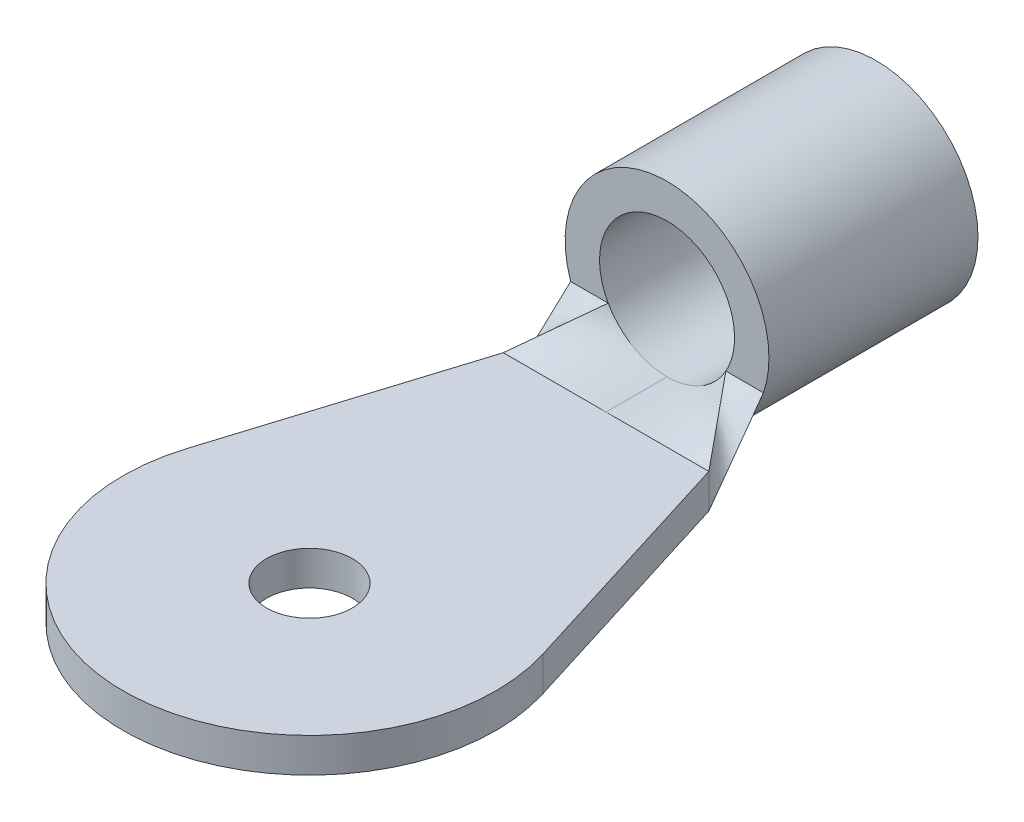
ISO-10303-21;
HEADER;
FILE_DESCRIPTION(('STEP AP214'),'2;1');
FILE_NAME('part.step','',(''),(''),'','','');
FILE_SCHEMA(('AUTOMOTIVE_DESIGN { 1 0 10303 214 1 1 1 1 }'));
ENDSEC;
DATA;
#1=APPLICATION_CONTEXT('core data for automotive mechanical design processes');
#2=APPLICATION_PROTOCOL_DEFINITION('international standard','automotive_design',2000,#1);
#3=PRODUCT_CONTEXT('',#1,'mechanical');
#4=PRODUCT('Part','Part','',(#3));
#5=PRODUCT_RELATED_PRODUCT_CATEGORY('part','',(#4));
#6=PRODUCT_DEFINITION_FORMATION('','',#4);
#7=PRODUCT_DEFINITION_CONTEXT('part definition',#1,'design');
#8=PRODUCT_DEFINITION('design','',#6,#7);
#9=PRODUCT_DEFINITION_SHAPE('','',#8);
#10=(LENGTH_UNIT() NAMED_UNIT(*) SI_UNIT(.MILLI.,.METRE.));
#11=(NAMED_UNIT(*) PLANE_ANGLE_UNIT() SI_UNIT($,.RADIAN.));
#12=(NAMED_UNIT(*) SI_UNIT($,.STERADIAN.) SOLID_ANGLE_UNIT());
#13=UNCERTAINTY_MEASURE_WITH_UNIT(LENGTH_MEASURE(1.E-05),#10,'distance_accuracy_value','');
#14=(GEOMETRIC_REPRESENTATION_CONTEXT(3) GLOBAL_UNCERTAINTY_ASSIGNED_CONTEXT((#13)) GLOBAL_UNIT_ASSIGNED_CONTEXT((#10,
#11,#12)) REPRESENTATION_CONTEXT('',''));
#15=CARTESIAN_POINT('',(0.,0.,0.));
#16=DIRECTION('',(0.,0.,1.));
#17=DIRECTION('',(1.,0.,0.));
#18=AXIS2_PLACEMENT_3D('',#15,#16,#17);
#19=CARTESIAN_POINT('',(0.,2.9718,-20.47354018104));
#20=DIRECTION('',(0.,0.,-1.));
#21=DIRECTION('',(0.,-1.,0.));
#22=AXIS2_PLACEMENT_3D('',#19,#20,#21);
#23=TOROIDAL_SURFACE('',#22,4.7371,2.7686);
#24=CARTESIAN_POINT('',(0.,2.9718,-20.47354018104));
#25=DIRECTION('',(0.,0.,1.));
#26=DIRECTION('',(1.,0.,0.));
#27=AXIS2_PLACEMENT_3D('',#24,#25,#26);
#28=CIRCLE('',#27,1.9685);
#29=CARTESIAN_POINT('',(1.9685,2.9718,-20.47354018104));
#30=VERTEX_POINT('',#29);
#31=EDGE_CURVE('E407',#30,#30,#28,.T.);
#32=ORIENTED_EDGE('',*,*,#31,.T.);
#33=EDGE_LOOP('',(#32));
#34=FACE_BOUND('',#33,.T.);
#35=CARTESIAN_POINT('',(0.,2.9718,-21.9583));
#36=DIRECTION('',(0.,0.,-1.));
#37=DIRECTION('',(-1.,0.,0.));
#38=AXIS2_PLACEMENT_3D('',#35,#36,#37);
#39=CIRCLE('',#38,2.4002999999996);
#40=CARTESIAN_POINT('',(-2.4002999999996,2.9718,-21.9583));
#41=VERTEX_POINT('',#40);
#42=EDGE_CURVE('E406',#41,#41,#39,.F.);
#43=ORIENTED_EDGE('',*,*,#42,.F.);
#44=EDGE_LOOP('',(#43));
#45=FACE_BOUND('',#44,.T.);
#46=ADVANCED_FACE('F43',(#34,#45),#23,.T.);
#47=CARTESIAN_POINT('',(0.,2.9718,-15.5575));
#48=DIRECTION('',(0.,0.,1.));
#49=DIRECTION('',(1.,0.,0.));
#50=AXIS2_PLACEMENT_3D('',#47,#48,#49);
#51=CYLINDRICAL_SURFACE('',#50,1.9685);
#52=ORIENTED_EDGE('',*,*,#31,.F.);
#53=EDGE_LOOP('',(#52));
#54=FACE_BOUND('',#53,.T.);
#55=CARTESIAN_POINT('',(1.73567280692567,2.04312774495081,-15.8622999999999));
#56=CARTESIAN_POINT('',(1.72912048872111,2.03088157255962,-15.8622999999999));
#57=CARTESIAN_POINT('',(1.55542623465408,1.71425828052444,-15.8622999999999));
#58=CARTESIAN_POINT('',(1.04117832760495,1.19140008908232,-15.8622999999999));
#59=CARTESIAN_POINT('',(0.333338600034629,0.999581116255773,-15.8622999999999));
#60=CARTESIAN_POINT('',(-0.0277778049131523,1.00344699680981,-15.8622999999999));
#61=CARTESIAN_POINT('',(-0.0416635961835322,1.00374095750298,-15.8622999999999));
#62=B_SPLINE_CURVE_WITH_KNOTS('',3,(#55,#56,#57,#58,#59,#60,#61),.UNSPECIFIED.,.F.,.F.,(4,1,1,1,
4),(-0.02,0.,0.5,1.,1.02),.UNSPECIFIED.);
#63=CARTESIAN_POINT('',(1.71562851748047,2.00660000000332,-15.8623000000008));
#64=VERTEX_POINT('',#63);
#65=CARTESIAN_POINT('',(0.,1.00329999999982,-15.8623));
#66=VERTEX_POINT('',#65);
#67=EDGE_CURVE('E241',#64,#66,#62,.T.);
#68=ORIENTED_EDGE('',*,*,#67,.F.);
#69=CARTESIAN_POINT('',(0.,2.9718,-15.8623));
#70=DIRECTION('',(0.,0.,1.));
#71=DIRECTION('',(1.,0.,0.));
#72=AXIS2_PLACEMENT_3D('',#69,#70,#71);
#73=CIRCLE('',#72,1.9685);
#74=CARTESIAN_POINT('',(-1.71562851748025,2.00660000000342,-15.8623000000009));
#75=VERTEX_POINT('',#74);
#76=EDGE_CURVE('E402',#64,#75,#73,.T.);
#77=ORIENTED_EDGE('',*,*,#76,.T.);
#78=CARTESIAN_POINT('',(0.0416635961835409,1.00374095750298,-15.8623));
#79=CARTESIAN_POINT('',(0.0277778049131612,1.00344699680981,-15.8623));
#80=CARTESIAN_POINT('',(-0.333338600034622,0.999581116255773,-15.8623));
#81=CARTESIAN_POINT('',(-1.04117832760493,1.19140008908233,-15.8623));
#82=CARTESIAN_POINT('',(-1.55542623465404,1.71425828052447,-15.8623));
#83=CARTESIAN_POINT('',(-1.72912048872105,2.03088157255967,-15.8623));
#84=CARTESIAN_POINT('',(-1.73567280692561,2.04312774495086,-15.8623));
#85=B_SPLINE_CURVE_WITH_KNOTS('',3,(#78,#79,#80,#81,#82,#83,#84),.UNSPECIFIED.,.F.,.F.,(4,1,1,1,
4),(-0.02,0.,0.5,1.,1.02),.UNSPECIFIED.);
#86=EDGE_CURVE('E240',#66,#75,#85,.T.);
#87=ORIENTED_EDGE('',*,*,#86,.F.);
#88=EDGE_LOOP('',(#68,#77,#87));
#89=FACE_BOUND('',#88,.T.);
#90=ADVANCED_FACE('F409',(#54,#89),#51,.F.);
#91=CARTESIAN_POINT('',(0.,2.9718,-15.8623));
#92=DIRECTION('',(0.,0.,-1.));
#93=DIRECTION('',(-1.,0.,0.));
#94=AXIS2_PLACEMENT_3D('',#91,#92,#93);
#95=PLANE('',#94);
#96=DIRECTION('',(-1.,-2.6112567753143E-11,0.));
#97=VECTOR('',#96,1.);
#98=CARTESIAN_POINT('',(-2.26315978564953,2.00660000000011,-15.8623000000003));
#99=LINE('',#98,#97);
#100=CARTESIAN_POINT('',(-2.81069105381626,2.00659999999977,-15.8623000000002));
#101=VERTEX_POINT('',#100);
#102=EDGE_CURVE('E198',#75,#101,#99,.T.);
#103=ORIENTED_EDGE('',*,*,#102,.F.);
#104=ORIENTED_EDGE('',*,*,#76,.F.);
#105=DIRECTION('',(-1.,2.6388266055217E-11,0.));
#106=VECTOR('',#105,1.);
#107=CARTESIAN_POINT('',(2.26315978564952,2.00659999999979,-15.8622999999999));
#108=LINE('',#107,#106);
#109=CARTESIAN_POINT('',(2.81069105381625,2.00659999999938,-15.8623));
#110=VERTEX_POINT('',#109);
#111=EDGE_CURVE('E229',#110,#64,#108,.T.);
#112=ORIENTED_EDGE('',*,*,#111,.F.);
#113=CARTESIAN_POINT('',(0.,2.9718,-15.8623));
#114=DIRECTION('',(0.,0.,1.));
#115=DIRECTION('',(1.,0.,0.));
#116=AXIS2_PLACEMENT_3D('',#113,#114,#115);
#117=CIRCLE('',#116,2.9718);
#118=EDGE_CURVE('E184',#101,#110,#117,.F.);
#119=ORIENTED_EDGE('',*,*,#118,.F.);
#120=EDGE_LOOP('',(#103,#104,#112,#119));
#121=FACE_BOUND('',#120,.T.);
#122=ADVANCED_FACE('F401',(#121),#95,.F.);
#123=CARTESIAN_POINT('',(0.,2.9718,-21.9583));
#124=DIRECTION('',(0.,0.,-1.));
#125=DIRECTION('',(-1.,0.,0.));
#126=AXIS2_PLACEMENT_3D('',#123,#124,#125);
#127=PLANE('',#126);
#128=ORIENTED_EDGE('',*,*,#42,.T.);
#129=EDGE_LOOP('',(#128));
#130=FACE_BOUND('',#129,.T.);
#131=CARTESIAN_POINT('',(0.,2.9718,-21.9583));
#132=DIRECTION('',(0.,0.,1.));
#133=DIRECTION('',(1.,0.,0.));
#134=AXIS2_PLACEMENT_3D('',#131,#132,#133);
#135=CIRCLE('',#134,2.9718);
#136=CARTESIAN_POINT('',(2.9718,2.9718,-21.9583));
#137=VERTEX_POINT('',#136);
#138=EDGE_CURVE('E178',#137,#137,#135,.T.);
#139=ORIENTED_EDGE('',*,*,#138,.F.);
#140=EDGE_LOOP('',(#139));
#141=FACE_BOUND('',#140,.T.);
#142=ADVANCED_FACE('F427',(#130,#141),#127,.T.);
#143=CARTESIAN_POINT('',(-0.06030960807633,1.00329118085,-14.04874));
#144=CARTESIAN_POINT('',(-0.05397240141995,1.003444046118,-14.66511333333));
#145=CARTESIAN_POINT('',(-0.04763519476358,1.003596911386,-15.28148666667));
#146=CARTESIAN_POINT('',(-0.0412979881072,1.003749776653,-15.89786));
#147=CARTESIAN_POINT('',(-0.04020636390174,1.003297060064,-14.04874));
#148=CARTESIAN_POINT('',(-0.03598227849385,1.003348018958,-14.66511333333));
#149=CARTESIAN_POINT('',(-0.03175819308597,1.003398977852,-15.28148666667));
#150=CARTESIAN_POINT('',(-0.02753410767808,1.003449936746,-15.89786));
#151=CARTESIAN_POINT('',(0.4824762679993,1.003374377675,-14.04874));
#152=CARTESIAN_POINT('',(0.4317889560113,1.002085164644,-14.66511333333));
#153=CARTESIAN_POINT('',(0.3811016440233,1.000795951612,-15.28148666667));
#154=CARTESIAN_POINT('',(0.3304143320353,0.9995067385809,-15.89786));
#155=CARTESIAN_POINT('',(1.507748433448,0.9995379982183,-14.04874));
#156=CARTESIAN_POINT('',(1.349175587017,1.0647460291,-14.66511333333));
#157=CARTESIAN_POINT('',(1.190602740587,1.129954059982,-15.28148666667));
#158=CARTESIAN_POINT('',(1.032029894157,1.195162090864,-15.89786));
#159=CARTESIAN_POINT('',(2.536892435307,0.9890808343895,-14.04874));
#160=CARTESIAN_POINT('',(2.20332222332,1.235546371638,-14.66511333333));
#161=CARTESIAN_POINT('',(1.869752011334,1.482011908887,-15.28148666667));
#162=CARTESIAN_POINT('',(1.536181799347,1.728477446135,-15.89786));
#163=CARTESIAN_POINT('',(3.063323510226,0.9827483685488,-14.04874));
#164=CARTESIAN_POINT('',(2.609868888538,1.338976647036,-14.66511333333));
#165=CARTESIAN_POINT('',(2.15641426685,1.695204925523,-15.28148666667));
#166=CARTESIAN_POINT('',(1.702959645162,2.051433204011,-15.89786));
#167=CARTESIAN_POINT('',(3.083573423861,0.982503445101,-14.04874));
#168=CARTESIAN_POINT('',(2.625463410262,1.342977063351,-14.66511333333));
#169=CARTESIAN_POINT('',(2.167353396663,1.7034506816,-15.28148666667));
#170=CARTESIAN_POINT('',(1.709243383064,2.06392429985,-15.89786));
#171=B_SPLINE_SURFACE_WITH_KNOTS('',3,3,((#143,#144,#145,#146),(#147,#148,#149,#150),(#151,#152,
#153,#154),(#155,#156,#157,#158),(#159,#160,#161,#162),(#163,#164,#165,#166),(#167,#168,#169,
#170)),.UNSPECIFIED.,.F.,.F.,.F.,(4,1,1,1,4),(4,4),(-0.02,0.,0.5,1.,1.02),(-0.02,1.02),.UNSPECIFIED.);
#172=DIRECTION('',(0.531670783971899,-0.416227502590126,0.737618359016567));
#173=VECTOR('',#172,1.);
#174=CARTESIAN_POINT('',(2.35641425874146,1.50494999999971,-14.9733));
#175=LINE('',#174,#173);
#176=CARTESIAN_POINT('',(2.99720000000075,1.00329999999958,-14.0843000000006));
#177=VERTEX_POINT('',#176);
#178=EDGE_CURVE('E211',#64,#177,#175,.T.);
#179=DIRECTION('',(0.,-2.66312963326112E-13,-1.));
#180=VECTOR('',#179,1.);
#181=CARTESIAN_POINT('',(0.,1.00329999999991,-14.9733));
#182=LINE('',#181,#180);
#183=CARTESIAN_POINT('',(0.,1.00330000000005,-14.0843));
#184=VERTEX_POINT('',#183);
#185=EDGE_CURVE('E237',#184,#66,#182,.T.);
#186=DIRECTION('',(1.,0.,0.));
#187=VECTOR('',#186,1.);
#188=CARTESIAN_POINT('',(0.,1.0033,-14.0843));
#189=LINE('',#188,#187);
#190=EDGE_CURVE('E183',#177,#184,#189,.F.);
#191=ORIENTED_EDGE('',*,*,#178,.F.);
#192=ORIENTED_EDGE('',*,*,#67,.T.);
#193=ORIENTED_EDGE('',*,*,#185,.F.);
#194=ORIENTED_EDGE('',*,*,#190,.F.);
#195=EDGE_LOOP('',(#191,#192,#193,#194));
#196=FACE_BOUND('',#195,.T.);
#197=ADVANCED_FACE('F267',(#196),#171,.T.);
#198=CARTESIAN_POINT('',(-3.083573423861,0.982503445101,-14.04874));
#199=CARTESIAN_POINT('',(-2.625463410262,1.342977063351,-14.66511333333));
#200=CARTESIAN_POINT('',(-2.167353396663,1.7034506816,-15.28148666667));
#201=CARTESIAN_POINT('',(-1.709243383064,2.06392429985,-15.89786));
#202=CARTESIAN_POINT('',(-3.063323510226,0.9827483685488,-14.04874));
#203=CARTESIAN_POINT('',(-2.609868888538,1.338976647036,-14.66511333333));
#204=CARTESIAN_POINT('',(-2.15641426685,1.695204925523,-15.28148666667));
#205=CARTESIAN_POINT('',(-1.702959645162,2.051433204011,-15.89786));
#206=CARTESIAN_POINT('',(-2.536892435307,0.9890808343895,-14.04874));
#207=CARTESIAN_POINT('',(-2.20332222332,1.235546371638,-14.66511333333));
#208=CARTESIAN_POINT('',(-1.869752011334,1.482011908887,-15.28148666667));
#209=CARTESIAN_POINT('',(-1.536181799347,1.728477446135,-15.89786));
#210=CARTESIAN_POINT('',(-1.507748433448,0.9995379982183,-14.04874));
#211=CARTESIAN_POINT('',(-1.349175587017,1.0647460291,-14.66511333333));
#212=CARTESIAN_POINT('',(-1.190602740587,1.129954059982,-15.28148666667));
#213=CARTESIAN_POINT('',(-1.032029894157,1.195162090864,-15.89786));
#214=CARTESIAN_POINT('',(-0.4824762679993,1.003374377675,-14.04874));
#215=CARTESIAN_POINT('',(-0.4317889560113,1.002085164644,-14.66511333333));
#216=CARTESIAN_POINT('',(-0.3811016440233,1.000795951612,-15.28148666667));
#217=CARTESIAN_POINT('',(-0.3304143320353,0.9995067385809,-15.89786));
#218=CARTESIAN_POINT('',(0.04020636390174,1.003297060064,-14.04874));
#219=CARTESIAN_POINT('',(0.03598227849385,1.003348018958,-14.66511333333));
#220=CARTESIAN_POINT('',(0.03175819308597,1.003398977852,-15.28148666667));
#221=CARTESIAN_POINT('',(0.02753410767809,1.003449936746,-15.89786));
#222=CARTESIAN_POINT('',(0.06030960807633,1.00329118085,-14.04874));
#223=CARTESIAN_POINT('',(0.05397240141996,1.003444046118,-14.66511333333));
#224=CARTESIAN_POINT('',(0.04763519476358,1.003596911386,-15.28148666667));
#225=CARTESIAN_POINT('',(0.04129798810721,1.003749776653,-15.89786));
#226=B_SPLINE_SURFACE_WITH_KNOTS('',3,3,((#198,#199,#200,#201),(#202,#203,#204,#205),(#206,#207,
#208,#209),(#210,#211,#212,#213),(#214,#215,#216,#217),(#218,#219,#220,#221),(#222,#223,#224,
#225)),.UNSPECIFIED.,.F.,.F.,.F.,(4,1,1,1,4),(4,4),(-0.02,0.,0.5,1.,1.02),(-0.02,1.02),.UNSPECIFIED.);
#227=DIRECTION('',(0.531670783972059,0.416227502589954,-0.737618359016548));
#228=VECTOR('',#227,1.);
#229=CARTESIAN_POINT('',(-2.35641425874125,1.5049499999999,-14.9733));
#230=LINE('',#229,#228);
#231=CARTESIAN_POINT('',(-2.99720000000051,1.00329999999967,-14.0843000000006));
#232=VERTEX_POINT('',#231);
#233=EDGE_CURVE('E226',#232,#75,#230,.T.);
#234=DIRECTION('',(1.,0.,0.));
#235=VECTOR('',#234,1.);
#236=CARTESIAN_POINT('',(0.,1.0033,-14.0843));
#237=LINE('',#236,#235);
#238=EDGE_CURVE('E219',#184,#232,#237,.F.);
#239=ORIENTED_EDGE('',*,*,#185,.T.);
#240=ORIENTED_EDGE('',*,*,#86,.T.);
#241=ORIENTED_EDGE('',*,*,#233,.F.);
#242=ORIENTED_EDGE('',*,*,#238,.F.);
#243=EDGE_LOOP('',(#239,#240,#241,#242));
#244=FACE_BOUND('',#243,.T.);
#245=ADVANCED_FACE('F254',(#244),#226,.T.);
#246=CARTESIAN_POINT('',(3.023492100984,1.014104774857,-14.04874));
#247=CARTESIAN_POINT('',(2.567762350591,1.351423413467,-14.66511333333));
#248=CARTESIAN_POINT('',(2.112032600198,1.688742052078,-15.28148666667));
#249=CARTESIAN_POINT('',(1.656302849805,2.026060690689,-15.89786));
#250=CARTESIAN_POINT('',(3.023271877206,1.003814516571,-14.04874));
#251=CARTESIAN_POINT('',(2.571359338964,1.344630497867,-14.66511333333));
#252=CARTESIAN_POINT('',(2.119446800723,1.685446479163,-15.28148666667));
#253=CARTESIAN_POINT('',(1.667534262481,2.026262460459,-15.89786));
#254=CARTESIAN_POINT('',(3.015751236519,0.6524022582855,-14.04874));
#255=CARTESIAN_POINT('',(2.694196470183,1.112652471156,-14.66511333333));
#256=CARTESIAN_POINT('',(2.372641703846,1.572902684026,-15.28148666667));
#257=CARTESIAN_POINT('',(2.05108693751,2.033152896896,-15.89786));
#258=CARTESIAN_POINT('',(3.008010372055,0.2906997417145,-14.04874));
#259=CARTESIAN_POINT('',(2.820630589775,0.8738815288442,-14.66511333333));
#260=CARTESIAN_POINT('',(2.633250807495,1.457063315974,-15.28148666667));
#261=CARTESIAN_POINT('',(2.445871025215,2.040245103104,-15.89786));
#262=CARTESIAN_POINT('',(3.000489731368,-0.06071251657109,-14.04874));
#263=CARTESIAN_POINT('',(2.943467720993,0.6419035021328,-14.66511333333));
#264=CARTESIAN_POINT('',(2.886445710618,1.344519520837,-15.28148666667));
#265=CARTESIAN_POINT('',(2.829423700244,2.047135539541,-15.89786));
#266=CARTESIAN_POINT('',(3.00026950759,-0.07100277485664,-14.04874));
#267=CARTESIAN_POINT('',(2.947064709366,0.6351105865325,-14.66511333333));
#268=CARTESIAN_POINT('',(2.893859911143,1.341223947922,-15.28148666667));
#269=CARTESIAN_POINT('',(2.84065511292,2.047337309311,-15.89786));
#270=B_SPLINE_SURFACE_WITH_KNOTS('',3,3,((#246,#247,#248,#249),(#250,#251,#252,#253),(#254,#255,
#256,#257),(#258,#259,#260,#261),(#262,#263,#264,#265),(#266,#267,#268,#269)),.UNSPECIFIED.,.F.,
.F.,.F.,(4,1,1,4),(4,4),(-0.03016591801627,0.,1.,1.030165918016),(-0.02,1.02),.UNSPECIFIED.);
#271=DIRECTION('',(0.0693993651602205,-0.746649257210498,0.661587949423483));
#272=VECTOR('',#271,1.);
#273=CARTESIAN_POINT('',(2.90394552690788,1.00329999999997,-14.9733));
#274=LINE('',#273,#272);
#275=CARTESIAN_POINT('',(2.9972,-5.9988906203623E-13,-14.0843000000007));
#276=VERTEX_POINT('',#275);
#277=EDGE_CURVE('E145',#110,#276,#274,.T.);
#278=DIRECTION('',(0.,1.,0.));
#279=VECTOR('',#278,1.);
#280=CARTESIAN_POINT('',(2.99720000000048,0.,-14.0843000000002));
#281=LINE('',#280,#279);
#282=EDGE_CURVE('E120',#276,#177,#281,.T.);
#283=ORIENTED_EDGE('',*,*,#277,.F.);
#284=ORIENTED_EDGE('',*,*,#111,.T.);
#285=ORIENTED_EDGE('',*,*,#178,.T.);
#286=ORIENTED_EDGE('',*,*,#282,.F.);
#287=EDGE_LOOP('',(#283,#284,#285,#286));
#288=FACE_BOUND('',#287,.T.);
#289=ADVANCED_FACE('F266',(#288),#270,.T.);
#290=CARTESIAN_POINT('',(-3.00026950759,-0.07100277485664,-14.04874));
#291=CARTESIAN_POINT('',(-2.947064709366,0.6351105865325,-14.66511333333));
#292=CARTESIAN_POINT('',(-2.893859911143,1.341223947922,-15.28148666667));
#293=CARTESIAN_POINT('',(-2.84065511292,2.047337309311,-15.89786));
#294=CARTESIAN_POINT('',(-3.000489731368,-0.06071251657109,-14.04874));
#295=CARTESIAN_POINT('',(-2.943467720993,0.6419035021328,-14.66511333333));
#296=CARTESIAN_POINT('',(-2.886445710618,1.344519520837,-15.28148666667));
#297=CARTESIAN_POINT('',(-2.829423700244,2.047135539541,-15.89786));
#298=CARTESIAN_POINT('',(-3.008010372055,0.2906997417145,-14.04874));
#299=CARTESIAN_POINT('',(-2.820630589775,0.8738815288442,-14.66511333333));
#300=CARTESIAN_POINT('',(-2.633250807495,1.457063315974,-15.28148666667));
#301=CARTESIAN_POINT('',(-2.445871025215,2.040245103104,-15.89786));
#302=CARTESIAN_POINT('',(-3.015751236519,0.6524022582855,-14.04874));
#303=CARTESIAN_POINT('',(-2.694196470183,1.112652471156,-14.66511333333));
#304=CARTESIAN_POINT('',(-2.372641703846,1.572902684026,-15.28148666667));
#305=CARTESIAN_POINT('',(-2.05108693751,2.033152896896,-15.89786));
#306=CARTESIAN_POINT('',(-3.023271877206,1.003814516571,-14.04874));
#307=CARTESIAN_POINT('',(-2.571359338964,1.344630497867,-14.66511333333));
#308=CARTESIAN_POINT('',(-2.119446800723,1.685446479163,-15.28148666667));
#309=CARTESIAN_POINT('',(-1.667534262481,2.026262460459,-15.89786));
#310=CARTESIAN_POINT('',(-3.023492100984,1.014104774857,-14.04874));
#311=CARTESIAN_POINT('',(-2.567762350591,1.351423413467,-14.66511333333));
#312=CARTESIAN_POINT('',(-2.112032600198,1.688742052078,-15.28148666667));
#313=CARTESIAN_POINT('',(-1.656302849805,2.026060690689,-15.89786));
#314=B_SPLINE_SURFACE_WITH_KNOTS('',3,3,((#290,#291,#292,#293),(#294,#295,#296,#297),(#298,#299,
#300,#301),(#302,#303,#304,#305),(#306,#307,#308,#309),(#310,#311,#312,#313)),.UNSPECIFIED.,.F.,
.F.,.F.,(4,1,1,4),(4,4),(-0.03016591801627,0.,1.,1.030165918016),(-0.02,1.02),.UNSPECIFIED.);
#315=DIRECTION('',(0.0693993651602916,0.746649257210564,-0.661587949423402));
#316=VECTOR('',#315,1.);
#317=CARTESIAN_POINT('',(-2.90394552690814,1.00330000000018,-14.9733));
#318=LINE('',#317,#316);
#319=CARTESIAN_POINT('',(-2.99719999999997,-5.95443833129039E-13,-14.0843000000007));
#320=VERTEX_POINT('',#319);
#321=EDGE_CURVE('E344',#320,#101,#318,.T.);
#322=DIRECTION('',(0.,1.,0.));
#323=VECTOR('',#322,1.);
#324=CARTESIAN_POINT('',(-2.9972,0.,-14.0843));
#325=LINE('',#324,#323);
#326=EDGE_CURVE('E135',#232,#320,#325,.F.);
#327=ORIENTED_EDGE('',*,*,#233,.T.);
#328=ORIENTED_EDGE('',*,*,#102,.T.);
#329=ORIENTED_EDGE('',*,*,#321,.F.);
#330=ORIENTED_EDGE('',*,*,#326,.F.);
#331=EDGE_LOOP('',(#327,#328,#329,#330));
#332=FACE_BOUND('',#331,.T.);
#333=ADVANCED_FACE('F281',(#332),#314,.T.);
#334=CARTESIAN_POINT('',(0.,2.9718,-15.5575));
#335=DIRECTION('',(0.,0.,1.));
#336=DIRECTION('',(1.,0.,0.));
#337=AXIS2_PLACEMENT_3D('',#334,#335,#336);
#338=CYLINDRICAL_SURFACE('',#337,2.9718);
#339=CARTESIAN_POINT('',(-0.0736937111272338,0.000913856617810988,-15.8623));
#340=CARTESIAN_POINT('',(-0.0491341771079927,0.000304650098919284,-15.8623));
#341=CARTESIAN_POINT('',(0.589627276546164,-0.00774236493291001,-15.8623));
#342=CARTESIAN_POINT('',(1.84083300811075,0.393302607661137,-15.8623));
#343=CARTESIAN_POINT('',(2.62651080902453,1.4464233252881,-15.8623));
#344=CARTESIAN_POINT('',(2.82636102838954,2.05316943277135,-15.8623));
#345=CARTESIAN_POINT('',(2.83376144932058,2.07659539302625,-15.8623));
#346=B_SPLINE_CURVE_WITH_KNOTS('',3,(#339,#340,#341,#342,#343,#344,#345),.UNSPECIFIED.,.F.,.F.,
(4,1,1,1,4),(-0.02,0.,0.5,1.,1.02),.UNSPECIFIED.);
#347=CARTESIAN_POINT('',(0.,0.,-15.8623000000001));
#348=VERTEX_POINT('',#347);
#349=EDGE_CURVE('E161',#348,#110,#346,.T.);
#350=ORIENTED_EDGE('',*,*,#349,.F.);
#351=CARTESIAN_POINT('',(-2.83376144932048,2.07659539302718,-15.8623000000008));
#352=CARTESIAN_POINT('',(-2.82636102838945,2.05316943277227,-15.8623000000008));
#353=CARTESIAN_POINT('',(-2.62651080902457,1.44642332528875,-15.8623000000008));
#354=CARTESIAN_POINT('',(-1.84083300811091,0.393302607661313,-15.8623000000008));
#355=CARTESIAN_POINT('',(-0.589627276546213,-0.00774236493291253,-15.8623000000008));
#356=CARTESIAN_POINT('',(0.0491341771079968,0.000304650098919421,-15.8623000000008));
#357=CARTESIAN_POINT('',(0.0736937111272399,0.000913856617811397,-15.8623000000008));
#358=B_SPLINE_CURVE_WITH_KNOTS('',3,(#351,#352,#353,#354,#355,#356,#357),.UNSPECIFIED.,.F.,.F.,
(4,1,1,1,4),(-0.02,0.,0.5,1.,1.02),.UNSPECIFIED.);
#359=EDGE_CURVE('E340',#101,#348,#358,.T.);
#360=ORIENTED_EDGE('',*,*,#359,.F.);
#361=ORIENTED_EDGE('',*,*,#118,.T.);
#362=EDGE_LOOP('',(#350,#360,#361));
#363=FACE_BOUND('',#362,.T.);
#364=ORIENTED_EDGE('',*,*,#138,.T.);
#365=EDGE_LOOP('',(#364));
#366=FACE_BOUND('',#365,.T.);
#367=ADVANCED_FACE('F291',(#363,#366),#338,.T.);
#368=CARTESIAN_POINT('',(0.,1.0033,0.));
#369=DIRECTION('',(0.,1.,0.));
#370=DIRECTION('',(0.,0.,1.));
#371=AXIS2_PLACEMENT_3D('',#368,#369,#370);
#372=PLANE('',#371);
#373=CARTESIAN_POINT('',(0.,1.0033,-5.4356));
#374=DIRECTION('',(0.,1.,0.));
#375=DIRECTION('',(0.,0.,1.));
#376=AXIS2_PLACEMENT_3D('',#373,#374,#375);
#377=CIRCLE('',#376,1.25);
#378=CARTESIAN_POINT('',(0.,1.0033,-4.1856));
#379=VERTEX_POINT('',#378);
#380=EDGE_CURVE('E507',#379,#379,#377,.T.);
#381=ORIENTED_EDGE('',*,*,#380,.F.);
#382=EDGE_LOOP('',(#381));
#383=FACE_BOUND('',#382,.T.);
#384=CARTESIAN_POINT('',(0.,1.0033,-5.4356));
#385=DIRECTION('',(0.,-1.,0.));
#386=DIRECTION('',(0.,0.,-1.));
#387=AXIS2_PLACEMENT_3D('',#384,#385,#386);
#388=CIRCLE('',#387,5.4356);
#389=CARTESIAN_POINT('',(5.18924004949497,1.0033,-7.0534798066361));
#390=VERTEX_POINT('',#389);
#391=CARTESIAN_POINT('',(-5.18924004949458,1.0033,-7.05347980663597));
#392=VERTEX_POINT('',#391);
#393=EDGE_CURVE('E127',#390,#392,#388,.T.);
#394=ORIENTED_EDGE('',*,*,#393,.F.);
#395=DIRECTION('',(-0.297645118595205,0.,-0.954676585748517));
#396=VECTOR('',#395,1.);
#397=CARTESIAN_POINT('',(5.189240049495,1.0033,-7.053479806636));
#398=LINE('',#397,#396);
#399=EDGE_CURVE('E112',#177,#390,#398,.F.);
#400=ORIENTED_EDGE('',*,*,#399,.F.);
#401=ORIENTED_EDGE('',*,*,#190,.T.);
#402=ORIENTED_EDGE('',*,*,#238,.T.);
#403=DIRECTION('',(-0.297645118595205,0.,0.954676585748517));
#404=VECTOR('',#403,1.);
#405=CARTESIAN_POINT('',(-2.9972,1.0033,-14.0843));
#406=LINE('',#405,#404);
#407=EDGE_CURVE('E131',#392,#232,#406,.F.);
#408=ORIENTED_EDGE('',*,*,#407,.F.);
#409=EDGE_LOOP('',(#394,#400,#401,#402,#408));
#410=FACE_BOUND('',#409,.T.);
#411=ADVANCED_FACE('F128',(#383,#410),#372,.T.);
#412=CARTESIAN_POINT('',(-2.9972,0.,-14.0843));
#413=DIRECTION('',(-0.954676585748517,0.,-0.297645118595205));
#414=DIRECTION('',(-0.297645118595205,0.,0.954676585748517));
#415=AXIS2_PLACEMENT_3D('',#412,#413,#414);
#416=PLANE('',#415);
#417=ORIENTED_EDGE('',*,*,#407,.T.);
#418=ORIENTED_EDGE('',*,*,#326,.T.);
#419=DIRECTION('',(-0.297645118595271,0.,0.954676585748497));
#420=VECTOR('',#419,1.);
#421=CARTESIAN_POINT('',(-2.9972,0.,-14.0843));
#422=LINE('',#421,#420);
#423=CARTESIAN_POINT('',(-5.18924004949477,0.,-7.05347980663623));
#424=VERTEX_POINT('',#423);
#425=EDGE_CURVE('E343',#320,#424,#422,.T.);
#426=ORIENTED_EDGE('',*,*,#425,.T.);
#427=DIRECTION('',(0.,-1.,0.));
#428=VECTOR('',#427,1.);
#429=CARTESIAN_POINT('',(-5.1892400494947,0.,-7.05347980663591));
#430=LINE('',#429,#428);
#431=EDGE_CURVE('E123',#392,#424,#430,.T.);
#432=ORIENTED_EDGE('',*,*,#431,.F.);
#433=EDGE_LOOP('',(#417,#418,#426,#432));
#434=FACE_BOUND('',#433,.T.);
#435=ADVANCED_FACE('F391',(#434),#416,.T.);
#436=CARTESIAN_POINT('',(0.,0.,-5.4356));
#437=DIRECTION('',(0.,-1.,0.));
#438=DIRECTION('',(0.,0.,-1.));
#439=AXIS2_PLACEMENT_3D('',#436,#437,#438);
#440=CYLINDRICAL_SURFACE('',#439,5.4356);
#441=ORIENTED_EDGE('',*,*,#431,.T.);
#442=CARTESIAN_POINT('',(0.,0.,-5.4356));
#443=DIRECTION('',(0.,-1.,0.));
#444=DIRECTION('',(0.,0.,-1.));
#445=AXIS2_PLACEMENT_3D('',#442,#443,#444);
#446=CIRCLE('',#445,5.4356);
#447=CARTESIAN_POINT('',(5.18924004949491,0.,-7.05347980663627));
#448=VERTEX_POINT('',#447);
#449=EDGE_CURVE('E140',#424,#448,#446,.F.);
#450=ORIENTED_EDGE('',*,*,#449,.T.);
#451=DIRECTION('',(0.,1.,0.));
#452=VECTOR('',#451,1.);
#453=CARTESIAN_POINT('',(5.189240049495,0.,-7.053479806636));
#454=LINE('',#453,#452);
#455=EDGE_CURVE('E117',#390,#448,#454,.F.);
#456=ORIENTED_EDGE('',*,*,#455,.F.);
#457=ORIENTED_EDGE('',*,*,#393,.T.);
#458=EDGE_LOOP('',(#441,#450,#456,#457));
#459=FACE_BOUND('',#458,.T.);
#460=ADVANCED_FACE('F138',(#459),#440,.T.);
#461=CARTESIAN_POINT('',(5.189240049495,0.,-7.053479806636));
#462=DIRECTION('',(0.954676585748517,0.,-0.297645118595205));
#463=DIRECTION('',(-0.297645118595205,0.,-0.954676585748517));
#464=AXIS2_PLACEMENT_3D('',#461,#462,#463);
#465=PLANE('',#464);
#466=DIRECTION('',(-0.297645118595271,0.,-0.954676585748497));
#467=VECTOR('',#466,1.);
#468=CARTESIAN_POINT('',(5.189240049495,0.,-7.053479806636));
#469=LINE('',#468,#467);
#470=EDGE_CURVE('E156',#448,#276,#469,.T.);
#471=ORIENTED_EDGE('',*,*,#470,.T.);
#472=ORIENTED_EDGE('',*,*,#282,.T.);
#473=ORIENTED_EDGE('',*,*,#399,.T.);
#474=ORIENTED_EDGE('',*,*,#455,.T.);
#475=EDGE_LOOP('',(#471,#472,#473,#474));
#476=FACE_BOUND('',#475,.T.);
#477=ADVANCED_FACE('F115',(#476),#465,.T.);
#478=CARTESIAN_POINT('',(3.061611651014,-0.04153190786052,-14.04874));
#479=CARTESIAN_POINT('',(2.984172366778,0.6783544950552,-14.66511333333));
#480=CARTESIAN_POINT('',(2.906733082542,1.398240897971,-15.28148666667));
#481=CARTESIAN_POINT('',(2.829293798307,2.118127300887,-15.89786));
#482=CARTESIAN_POINT('',(3.041378699432,-0.04106338865542,-14.04874));
#483=CARTESIAN_POINT('',(2.968300798163,0.6707020147053,-14.66511333333));
#484=CARTESIAN_POINT('',(2.895222896893,1.382467418066,-15.28148666667));
#485=CARTESIAN_POINT('',(2.822144995624,2.094232821427,-15.89786));
#486=CARTESIAN_POINT('',(2.51547074382,-0.02892846650577,-14.04874));
#487=CARTESIAN_POINT('',(2.553209850948,0.4724982862609,-14.66511333333));
#488=CARTESIAN_POINT('',(2.590948958077,0.9739250390277,-15.28148666667));
#489=CARTESIAN_POINT('',(2.628688065205,1.475351791794,-15.89786));
#490=CARTESIAN_POINT('',(1.491755339838,-0.007866052153224,-14.04874));
#491=CARTESIAN_POINT('',(1.610396115983,0.128478851836,-14.66511333333));
#492=CARTESIAN_POINT('',(1.729036892128,0.2648237558252,-15.28148666667));
#493=CARTESIAN_POINT('',(1.847677668273,0.4011686598144,-15.89786));
#494=CARTESIAN_POINT('',(0.4773504944691,0.0001548472986582,-14.04874));
#495=CARTESIAN_POINT('',(0.5155099236718,-0.002529172544751,-14.66511333333));
#496=CARTESIAN_POINT('',(0.5536693528744,-0.00521319238816,-15.28148666667));
#497=CARTESIAN_POINT('',(0.5918287820771,-0.007897212231569,-15.89786));
#498=CARTESIAN_POINT('',(-0.03977923645784,-6.093001978386E-06,-14.04874));
#499=CARTESIAN_POINT('',(-0.04295869341083,9.951903231364E-05,-14.66511333333));
#500=CARTESIAN_POINT('',(-0.04613815036383,0.0002051310666057,-15.28148666667));
#501=CARTESIAN_POINT('',(-0.04931760731682,0.0003107431008977,-15.89786));
#502=CARTESIAN_POINT('',(-0.05966900577746,-1.827713235622E-05,-14.04874));
#503=CARTESIAN_POINT('',(-0.06443557230156,0.0002985264951516,-14.66511333333));
#504=CARTESIAN_POINT('',(-0.06920213882567,0.0006153301226595,-15.28148666667));
#505=CARTESIAN_POINT('',(-0.07396870534978,0.0009321337501673,-15.89786));
#506=B_SPLINE_SURFACE_WITH_KNOTS('',3,3,((#478,#479,#480,#481),(#482,#483,#484,#485),(#486,#487,
#488,#489),(#490,#491,#492,#493),(#494,#495,#496,#497),(#498,#499,#500,#501),(#502,#503,#504,
#505)),.UNSPECIFIED.,.F.,.F.,.F.,(4,1,1,1,4),(4,4),(-0.02,0.,0.5,1.,1.02),(-0.02,1.02),.UNSPECIFIED.);
#507=DIRECTION('',(0.,0.,1.));
#508=VECTOR('',#507,1.);
#509=CARTESIAN_POINT('',(0.,0.,-14.9733));
#510=LINE('',#509,#508);
#511=CARTESIAN_POINT('',(0.,0.,-14.0843));
#512=VERTEX_POINT('',#511);
#513=EDGE_CURVE('E67',#348,#512,#510,.T.);
#514=DIRECTION('',(1.,0.,0.));
#515=VECTOR('',#514,1.);
#516=CARTESIAN_POINT('',(0.,0.,-14.0843));
#517=LINE('',#516,#515);
#518=EDGE_CURVE('E59',#276,#512,#517,.F.);
#519=ORIENTED_EDGE('',*,*,#513,.F.);
#520=ORIENTED_EDGE('',*,*,#349,.T.);
#521=ORIENTED_EDGE('',*,*,#277,.T.);
#522=ORIENTED_EDGE('',*,*,#518,.T.);
#523=EDGE_LOOP('',(#519,#520,#521,#522));
#524=FACE_BOUND('',#523,.T.);
#525=ADVANCED_FACE('F293',(#524),#506,.T.);
#526=CARTESIAN_POINT('',(0.05966900577746,-1.827713235622E-05,-14.04874));
#527=CARTESIAN_POINT('',(0.06443557230156,0.0002985264951516,-14.66511333333));
#528=CARTESIAN_POINT('',(0.06920213882567,0.0006153301226595,-15.28148666667));
#529=CARTESIAN_POINT('',(0.07396870534978,0.0009321337501673,-15.89786));
#530=CARTESIAN_POINT('',(0.03977923645784,-6.093001978386E-06,-14.04874));
#531=CARTESIAN_POINT('',(0.04295869341083,9.951903231363E-05,-14.66511333333));
#532=CARTESIAN_POINT('',(0.04613815036383,0.0002051310666057,-15.28148666667));
#533=CARTESIAN_POINT('',(0.04931760731682,0.0003107431008977,-15.89786));
#534=CARTESIAN_POINT('',(-0.4773504944691,0.0001548472986582,-14.04874));
#535=CARTESIAN_POINT('',(-0.5155099236718,-0.002529172544751,-14.66511333333));
#536=CARTESIAN_POINT('',(-0.5536693528744,-0.00521319238816,-15.28148666667));
#537=CARTESIAN_POINT('',(-0.5918287820771,-0.007897212231568,-15.89786));
#538=CARTESIAN_POINT('',(-1.491755339838,-0.007866052153224,-14.04874));
#539=CARTESIAN_POINT('',(-1.610396115983,0.128478851836,-14.66511333333));
#540=CARTESIAN_POINT('',(-1.729036892128,0.2648237558252,-15.28148666667));
#541=CARTESIAN_POINT('',(-1.847677668273,0.4011686598144,-15.89786));
#542=CARTESIAN_POINT('',(-2.51547074382,-0.02892846650577,-14.04874));
#543=CARTESIAN_POINT('',(-2.553209850948,0.4724982862609,-14.66511333333));
#544=CARTESIAN_POINT('',(-2.590948958077,0.9739250390276,-15.28148666667));
#545=CARTESIAN_POINT('',(-2.628688065205,1.475351791794,-15.89786));
#546=CARTESIAN_POINT('',(-3.041378699432,-0.04106338865542,-14.04874));
#547=CARTESIAN_POINT('',(-2.968300798163,0.6707020147053,-14.66511333333));
#548=CARTESIAN_POINT('',(-2.895222896893,1.382467418066,-15.28148666667));
#549=CARTESIAN_POINT('',(-2.822144995624,2.094232821427,-15.89786));
#550=CARTESIAN_POINT('',(-3.061611651014,-0.04153190786052,-14.04874));
#551=CARTESIAN_POINT('',(-2.984172366778,0.6783544950552,-14.66511333333));
#552=CARTESIAN_POINT('',(-2.906733082542,1.398240897971,-15.28148666667));
#553=CARTESIAN_POINT('',(-2.829293798307,2.118127300887,-15.89786));
#554=B_SPLINE_SURFACE_WITH_KNOTS('',3,3,((#526,#527,#528,#529),(#530,#531,#532,#533),(#534,#535,
#536,#537),(#538,#539,#540,#541),(#542,#543,#544,#545),(#546,#547,#548,#549),(#550,#551,#552,
#553)),.UNSPECIFIED.,.F.,.F.,.F.,(4,1,1,1,4),(4,4),(-0.02,0.,0.5,1.,1.02),(-0.02,1.02),.UNSPECIFIED.);
#555=DIRECTION('',(1.,0.,0.));
#556=VECTOR('',#555,1.);
#557=CARTESIAN_POINT('',(0.,0.,-14.0843));
#558=LINE('',#557,#556);
#559=EDGE_CURVE('E12',#512,#320,#558,.F.);
#560=ORIENTED_EDGE('',*,*,#321,.T.);
#561=ORIENTED_EDGE('',*,*,#359,.T.);
#562=ORIENTED_EDGE('',*,*,#513,.T.);
#563=ORIENTED_EDGE('',*,*,#559,.T.);
#564=EDGE_LOOP('',(#560,#561,#562,#563));
#565=FACE_BOUND('',#564,.T.);
#566=ADVANCED_FACE('F45',(#565),#554,.T.);
#567=CARTESIAN_POINT('',(0.,0.,0.));
#568=DIRECTION('',(0.,1.,0.));
#569=DIRECTION('',(0.,0.,1.));
#570=AXIS2_PLACEMENT_3D('',#567,#568,#569);
#571=PLANE('',#570);
#572=CARTESIAN_POINT('',(0.,0.,-5.4356));
#573=DIRECTION('',(0.,1.,0.));
#574=DIRECTION('',(0.,0.,1.));
#575=AXIS2_PLACEMENT_3D('',#572,#573,#574);
#576=CIRCLE('',#575,1.25);
#577=CARTESIAN_POINT('',(0.,0.,-4.1856));
#578=VERTEX_POINT('',#577);
#579=EDGE_CURVE('E385',#578,#578,#576,.T.);
#580=ORIENTED_EDGE('',*,*,#579,.T.);
#581=EDGE_LOOP('',(#580));
#582=FACE_BOUND('',#581,.T.);
#583=ORIENTED_EDGE('',*,*,#518,.F.);
#584=ORIENTED_EDGE('',*,*,#470,.F.);
#585=ORIENTED_EDGE('',*,*,#449,.F.);
#586=ORIENTED_EDGE('',*,*,#425,.F.);
#587=ORIENTED_EDGE('',*,*,#559,.F.);
#588=EDGE_LOOP('',(#583,#584,#585,#586,#587));
#589=FACE_BOUND('',#588,.T.);
#590=ADVANCED_FACE('F379',(#582,#589),#571,.F.);
#591=CARTESIAN_POINT('',(0.,1.0033,-5.4356));
#592=DIRECTION('',(0.,1.,0.));
#593=DIRECTION('',(0.,0.,1.));
#594=AXIS2_PLACEMENT_3D('',#591,#592,#593);
#595=CYLINDRICAL_SURFACE('',#594,1.25);
#596=ORIENTED_EDGE('',*,*,#380,.T.);
#597=EDGE_LOOP('',(#596));
#598=FACE_BOUND('',#597,.T.);
#599=ORIENTED_EDGE('',*,*,#579,.F.);
#600=EDGE_LOOP('',(#599));
#601=FACE_BOUND('',#600,.T.);
#602=ADVANCED_FACE('F481',(#598,#601),#595,.F.);
#603=CLOSED_SHELL('',(#46,#90,#122,#142,#197,#245,#289,#333,#367,#411,#435,#460,#477,#525,#566,
#590,#602));
#604=MANIFOLD_SOLID_BREP('B2',#603);
#605=ADVANCED_BREP_SHAPE_REPRESENTATION('',(#18,#604),#14);
#606=SHAPE_DEFINITION_REPRESENTATION(#9,#605);
ENDSEC;
END-ISO-10303-21;
